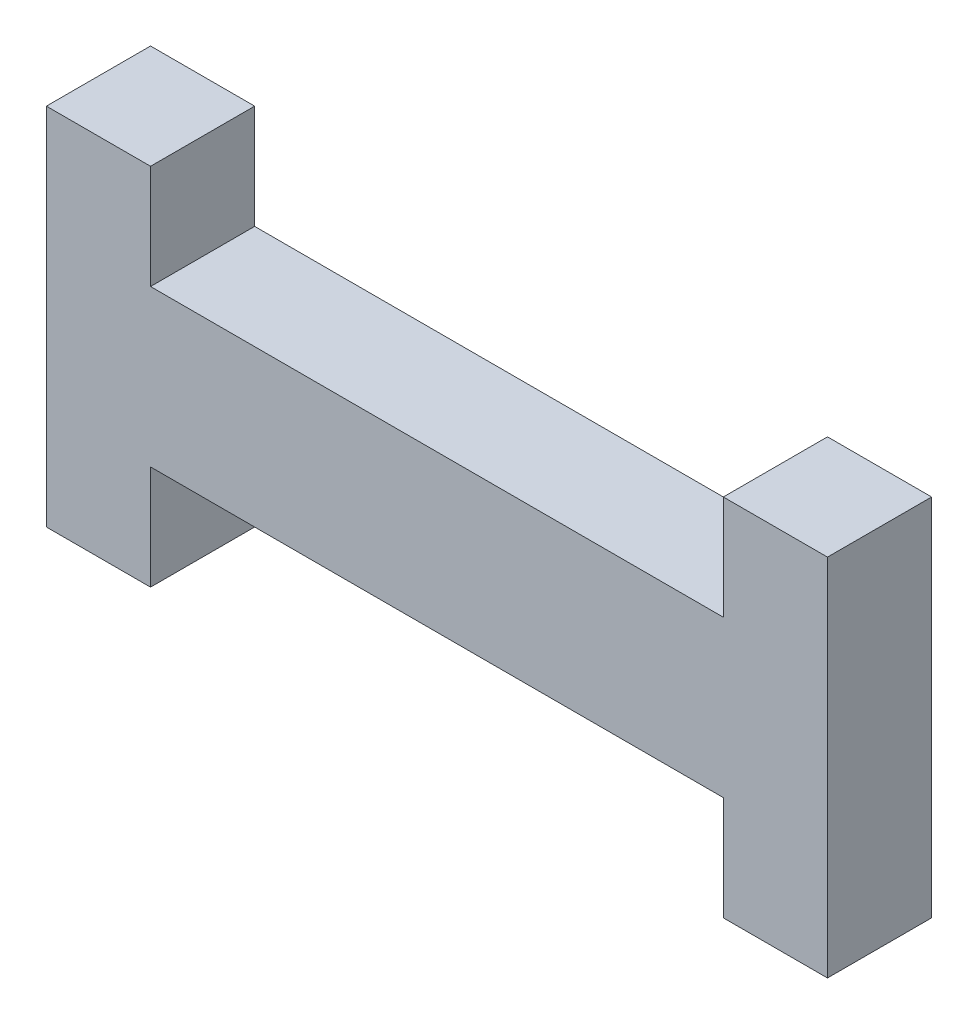
ISO-10303-21;
HEADER;
FILE_DESCRIPTION(('STEP AP214'),'2;1');
FILE_NAME('part.step','',(''),(''),'','','');
FILE_SCHEMA(('AUTOMOTIVE_DESIGN { 1 0 10303 214 1 1 1 1 }'));
ENDSEC;
DATA;
#1=APPLICATION_CONTEXT('core data for automotive mechanical design processes');
#2=APPLICATION_PROTOCOL_DEFINITION('international standard','automotive_design',2000,#1);
#3=PRODUCT_CONTEXT('',#1,'mechanical');
#4=PRODUCT('Part','Part','',(#3));
#5=PRODUCT_RELATED_PRODUCT_CATEGORY('part','',(#4));
#6=PRODUCT_DEFINITION_FORMATION('','',#4);
#7=PRODUCT_DEFINITION_CONTEXT('part definition',#1,'design');
#8=PRODUCT_DEFINITION('design','',#6,#7);
#9=PRODUCT_DEFINITION_SHAPE('','',#8);
#10=(LENGTH_UNIT() NAMED_UNIT(*) SI_UNIT(.MILLI.,.METRE.));
#11=(NAMED_UNIT(*) PLANE_ANGLE_UNIT() SI_UNIT($,.RADIAN.));
#12=(NAMED_UNIT(*) SI_UNIT($,.STERADIAN.) SOLID_ANGLE_UNIT());
#13=UNCERTAINTY_MEASURE_WITH_UNIT(LENGTH_MEASURE(1.E-05),#10,'distance_accuracy_value','');
#14=(GEOMETRIC_REPRESENTATION_CONTEXT(3) GLOBAL_UNCERTAINTY_ASSIGNED_CONTEXT((#13)) GLOBAL_UNIT_ASSIGNED_CONTEXT((#10,
#11,#12)) REPRESENTATION_CONTEXT('',''));
#15=CARTESIAN_POINT('',(0.,0.,0.));
#16=DIRECTION('',(0.,0.,1.));
#17=DIRECTION('',(1.,0.,0.));
#18=AXIS2_PLACEMENT_3D('',#15,#16,#17);
#19=CARTESIAN_POINT('',(0.,2.,2.));
#20=DIRECTION('',(-1.,0.,0.));
#21=DIRECTION('',(0.,-1.,0.));
#22=AXIS2_PLACEMENT_3D('',#19,#20,#21);
#23=PLANE('',#22);
#24=DIRECTION('',(0.,1.,0.));
#25=VECTOR('',#24,1.);
#26=CARTESIAN_POINT('',(0.,2.,0.));
#27=LINE('',#26,#25);
#28=CARTESIAN_POINT('',(0.,0.,0.));
#29=VERTEX_POINT('',#28);
#30=CARTESIAN_POINT('',(0.,2.,0.));
#31=VERTEX_POINT('',#30);
#32=EDGE_CURVE('E153',#29,#31,#27,.T.);
#33=ORIENTED_EDGE('',*,*,#32,.T.);
#34=DIRECTION('',(0.,0.,-1.));
#35=VECTOR('',#34,1.);
#36=CARTESIAN_POINT('',(0.,2.,2.));
#37=LINE('',#36,#35);
#38=CARTESIAN_POINT('',(0.,2.,2.));
#39=VERTEX_POINT('',#38);
#40=EDGE_CURVE('E11',#39,#31,#37,.T.);
#41=ORIENTED_EDGE('',*,*,#40,.F.);
#42=DIRECTION('',(0.,1.,0.));
#43=VECTOR('',#42,1.);
#44=CARTESIAN_POINT('',(0.,2.,2.));
#45=LINE('',#44,#43);
#46=CARTESIAN_POINT('',(0.,0.,2.));
#47=VERTEX_POINT('',#46);
#48=EDGE_CURVE('E175',#47,#39,#45,.T.);
#49=ORIENTED_EDGE('',*,*,#48,.F.);
#50=DIRECTION('',(0.,0.,-1.));
#51=VECTOR('',#50,1.);
#52=CARTESIAN_POINT('',(0.,0.,2.));
#53=LINE('',#52,#51);
#54=EDGE_CURVE('E149',#47,#29,#53,.T.);
#55=ORIENTED_EDGE('',*,*,#54,.T.);
#56=EDGE_LOOP('',(#33,#41,#49,#55));
#57=FACE_BOUND('',#56,.T.);
#58=ADVANCED_FACE('F33',(#57),#23,.F.);
#59=CARTESIAN_POINT('',(-2.,2.,2.));
#60=DIRECTION('',(0.,-1.,0.));
#61=DIRECTION('',(0.,0.,-1.));
#62=AXIS2_PLACEMENT_3D('',#59,#60,#61);
#63=PLANE('',#62);
#64=DIRECTION('',(-1.,0.,0.));
#65=VECTOR('',#64,1.);
#66=CARTESIAN_POINT('',(-2.,2.,0.));
#67=LINE('',#66,#65);
#68=CARTESIAN_POINT('',(-2.,2.,0.));
#69=VERTEX_POINT('',#68);
#70=EDGE_CURVE('E156',#31,#69,#67,.T.);
#71=ORIENTED_EDGE('',*,*,#70,.T.);
#72=DIRECTION('',(0.,0.,-1.));
#73=VECTOR('',#72,1.);
#74=CARTESIAN_POINT('',(-2.,2.,2.));
#75=LINE('',#74,#73);
#76=CARTESIAN_POINT('',(-2.,2.,2.));
#77=VERTEX_POINT('',#76);
#78=EDGE_CURVE('E41',#77,#69,#75,.T.);
#79=ORIENTED_EDGE('',*,*,#78,.F.);
#80=DIRECTION('',(-1.,0.,0.));
#81=VECTOR('',#80,1.);
#82=CARTESIAN_POINT('',(-2.,2.,2.));
#83=LINE('',#82,#81);
#84=EDGE_CURVE('E104',#39,#77,#83,.T.);
#85=ORIENTED_EDGE('',*,*,#84,.F.);
#86=ORIENTED_EDGE('',*,*,#40,.T.);
#87=EDGE_LOOP('',(#71,#79,#85,#86));
#88=FACE_BOUND('',#87,.T.);
#89=ADVANCED_FACE('F253',(#88),#63,.F.);
#90=CARTESIAN_POINT('',(-2.,-5.,2.));
#91=DIRECTION('',(1.,0.,0.));
#92=DIRECTION('',(0.,0.,-1.));
#93=AXIS2_PLACEMENT_3D('',#90,#91,#92);
#94=PLANE('',#93);
#95=DIRECTION('',(0.,-1.,0.));
#96=VECTOR('',#95,1.);
#97=CARTESIAN_POINT('',(-2.,-5.,0.));
#98=LINE('',#97,#96);
#99=CARTESIAN_POINT('',(-2.,-5.,0.));
#100=VERTEX_POINT('',#99);
#101=EDGE_CURVE('E158',#69,#100,#98,.T.);
#102=ORIENTED_EDGE('',*,*,#101,.T.);
#103=DIRECTION('',(0.,0.,-1.));
#104=VECTOR('',#103,1.);
#105=CARTESIAN_POINT('',(-2.,-5.,2.));
#106=LINE('',#105,#104);
#107=CARTESIAN_POINT('',(-2.,-5.,2.));
#108=VERTEX_POINT('',#107);
#109=EDGE_CURVE('E194',#108,#100,#106,.T.);
#110=ORIENTED_EDGE('',*,*,#109,.F.);
#111=DIRECTION('',(0.,-1.,0.));
#112=VECTOR('',#111,1.);
#113=CARTESIAN_POINT('',(-2.,-5.,2.));
#114=LINE('',#113,#112);
#115=EDGE_CURVE('E202',#77,#108,#114,.T.);
#116=ORIENTED_EDGE('',*,*,#115,.F.);
#117=ORIENTED_EDGE('',*,*,#78,.T.);
#118=EDGE_LOOP('',(#102,#110,#116,#117));
#119=FACE_BOUND('',#118,.T.);
#120=ADVANCED_FACE('F200',(#119),#94,.F.);
#121=CARTESIAN_POINT('',(0.,-5.,2.));
#122=DIRECTION('',(0.,1.,0.));
#123=DIRECTION('',(0.,0.,1.));
#124=AXIS2_PLACEMENT_3D('',#121,#122,#123);
#125=PLANE('',#124);
#126=DIRECTION('',(1.,0.,0.));
#127=VECTOR('',#126,1.);
#128=CARTESIAN_POINT('',(0.,-5.,0.));
#129=LINE('',#128,#127);
#130=CARTESIAN_POINT('',(0.,-5.,0.));
#131=VERTEX_POINT('',#130);
#132=EDGE_CURVE('E160',#100,#131,#129,.T.);
#133=ORIENTED_EDGE('',*,*,#132,.T.);
#134=DIRECTION('',(0.,0.,-1.));
#135=VECTOR('',#134,1.);
#136=CARTESIAN_POINT('',(0.,-5.,2.));
#137=LINE('',#136,#135);
#138=CARTESIAN_POINT('',(0.,-5.,2.));
#139=VERTEX_POINT('',#138);
#140=EDGE_CURVE('E191',#139,#131,#137,.T.);
#141=ORIENTED_EDGE('',*,*,#140,.F.);
#142=DIRECTION('',(1.,0.,0.));
#143=VECTOR('',#142,1.);
#144=CARTESIAN_POINT('',(0.,-5.,2.));
#145=LINE('',#144,#143);
#146=EDGE_CURVE('E220',#108,#139,#145,.T.);
#147=ORIENTED_EDGE('',*,*,#146,.F.);
#148=ORIENTED_EDGE('',*,*,#109,.T.);
#149=EDGE_LOOP('',(#133,#141,#147,#148));
#150=FACE_BOUND('',#149,.T.);
#151=ADVANCED_FACE('F211',(#150),#125,.F.);
#152=CARTESIAN_POINT('',(0.,-3.,2.));
#153=DIRECTION('',(-1.,0.,0.));
#154=DIRECTION('',(0.,-1.,0.));
#155=AXIS2_PLACEMENT_3D('',#152,#153,#154);
#156=PLANE('',#155);
#157=DIRECTION('',(0.,1.,0.));
#158=VECTOR('',#157,1.);
#159=CARTESIAN_POINT('',(0.,-3.,0.));
#160=LINE('',#159,#158);
#161=CARTESIAN_POINT('',(0.,-3.,0.));
#162=VERTEX_POINT('',#161);
#163=EDGE_CURVE('E162',#131,#162,#160,.T.);
#164=ORIENTED_EDGE('',*,*,#163,.T.);
#165=DIRECTION('',(0.,0.,-1.));
#166=VECTOR('',#165,1.);
#167=CARTESIAN_POINT('',(0.,-3.,2.));
#168=LINE('',#167,#166);
#169=CARTESIAN_POINT('',(0.,-3.,2.));
#170=VERTEX_POINT('',#169);
#171=EDGE_CURVE('E188',#170,#162,#168,.T.);
#172=ORIENTED_EDGE('',*,*,#171,.F.);
#173=DIRECTION('',(0.,1.,0.));
#174=VECTOR('',#173,1.);
#175=CARTESIAN_POINT('',(0.,-3.,2.));
#176=LINE('',#175,#174);
#177=EDGE_CURVE('E217',#139,#170,#176,.T.);
#178=ORIENTED_EDGE('',*,*,#177,.F.);
#179=ORIENTED_EDGE('',*,*,#140,.T.);
#180=EDGE_LOOP('',(#164,#172,#178,#179));
#181=FACE_BOUND('',#180,.T.);
#182=ADVANCED_FACE('F215',(#181),#156,.F.);
#183=CARTESIAN_POINT('',(11.,-3.,2.));
#184=DIRECTION('',(0.,1.,0.));
#185=DIRECTION('',(-1.,0.,0.));
#186=AXIS2_PLACEMENT_3D('',#183,#184,#185);
#187=PLANE('',#186);
#188=DIRECTION('',(1.,0.,0.));
#189=VECTOR('',#188,1.);
#190=CARTESIAN_POINT('',(11.,-3.,0.));
#191=LINE('',#190,#189);
#192=CARTESIAN_POINT('',(11.,-3.,0.));
#193=VERTEX_POINT('',#192);
#194=EDGE_CURVE('E164',#162,#193,#191,.T.);
#195=ORIENTED_EDGE('',*,*,#194,.T.);
#196=DIRECTION('',(0.,0.,-1.));
#197=VECTOR('',#196,1.);
#198=CARTESIAN_POINT('',(11.,-3.,2.));
#199=LINE('',#198,#197);
#200=CARTESIAN_POINT('',(11.,-3.,2.));
#201=VERTEX_POINT('',#200);
#202=EDGE_CURVE('E185',#201,#193,#199,.T.);
#203=ORIENTED_EDGE('',*,*,#202,.F.);
#204=DIRECTION('',(1.,0.,0.));
#205=VECTOR('',#204,1.);
#206=CARTESIAN_POINT('',(11.,-3.,2.));
#207=LINE('',#206,#205);
#208=EDGE_CURVE('E219',#170,#201,#207,.T.);
#209=ORIENTED_EDGE('',*,*,#208,.F.);
#210=ORIENTED_EDGE('',*,*,#171,.T.);
#211=EDGE_LOOP('',(#195,#203,#209,#210));
#212=FACE_BOUND('',#211,.T.);
#213=ADVANCED_FACE('F266',(#212),#187,.F.);
#214=CARTESIAN_POINT('',(11.,-5.,2.));
#215=DIRECTION('',(1.,0.,0.));
#216=DIRECTION('',(0.,0.,-1.));
#217=AXIS2_PLACEMENT_3D('',#214,#215,#216);
#218=PLANE('',#217);
#219=DIRECTION('',(0.,-1.,0.));
#220=VECTOR('',#219,1.);
#221=CARTESIAN_POINT('',(11.,-5.,0.));
#222=LINE('',#221,#220);
#223=CARTESIAN_POINT('',(11.,-5.,0.));
#224=VERTEX_POINT('',#223);
#225=EDGE_CURVE('E166',#193,#224,#222,.T.);
#226=ORIENTED_EDGE('',*,*,#225,.T.);
#227=DIRECTION('',(0.,0.,-1.));
#228=VECTOR('',#227,1.);
#229=CARTESIAN_POINT('',(11.,-5.,2.));
#230=LINE('',#229,#228);
#231=CARTESIAN_POINT('',(11.,-5.,2.));
#232=VERTEX_POINT('',#231);
#233=EDGE_CURVE('E182',#232,#224,#230,.T.);
#234=ORIENTED_EDGE('',*,*,#233,.F.);
#235=DIRECTION('',(0.,-1.,0.));
#236=VECTOR('',#235,1.);
#237=CARTESIAN_POINT('',(11.,-5.,2.));
#238=LINE('',#237,#236);
#239=EDGE_CURVE('E222',#201,#232,#238,.T.);
#240=ORIENTED_EDGE('',*,*,#239,.F.);
#241=ORIENTED_EDGE('',*,*,#202,.T.);
#242=EDGE_LOOP('',(#226,#234,#240,#241));
#243=FACE_BOUND('',#242,.T.);
#244=ADVANCED_FACE('F269',(#243),#218,.F.);
#245=CARTESIAN_POINT('',(13.,-5.,2.));
#246=DIRECTION('',(0.,1.,0.));
#247=DIRECTION('',(-1.,0.,0.));
#248=AXIS2_PLACEMENT_3D('',#245,#246,#247);
#249=PLANE('',#248);
#250=DIRECTION('',(1.,0.,0.));
#251=VECTOR('',#250,1.);
#252=CARTESIAN_POINT('',(13.,-5.,0.));
#253=LINE('',#252,#251);
#254=CARTESIAN_POINT('',(13.,-5.,0.));
#255=VERTEX_POINT('',#254);
#256=EDGE_CURVE('E168',#224,#255,#253,.T.);
#257=ORIENTED_EDGE('',*,*,#256,.T.);
#258=DIRECTION('',(0.,0.,-1.));
#259=VECTOR('',#258,1.);
#260=CARTESIAN_POINT('',(13.,-5.,2.));
#261=LINE('',#260,#259);
#262=CARTESIAN_POINT('',(13.,-5.,2.));
#263=VERTEX_POINT('',#262);
#264=EDGE_CURVE('E179',#263,#255,#261,.T.);
#265=ORIENTED_EDGE('',*,*,#264,.F.);
#266=DIRECTION('',(1.,0.,0.));
#267=VECTOR('',#266,1.);
#268=CARTESIAN_POINT('',(13.,-5.,2.));
#269=LINE('',#268,#267);
#270=EDGE_CURVE('E228',#232,#263,#269,.T.);
#271=ORIENTED_EDGE('',*,*,#270,.F.);
#272=ORIENTED_EDGE('',*,*,#233,.T.);
#273=EDGE_LOOP('',(#257,#265,#271,#272));
#274=FACE_BOUND('',#273,.T.);
#275=ADVANCED_FACE('F234',(#274),#249,.F.);
#276=CARTESIAN_POINT('',(13.,2.,2.));
#277=DIRECTION('',(-1.,0.,0.));
#278=DIRECTION('',(0.,0.,1.));
#279=AXIS2_PLACEMENT_3D('',#276,#277,#278);
#280=PLANE('',#279);
#281=DIRECTION('',(0.,1.,0.));
#282=VECTOR('',#281,1.);
#283=CARTESIAN_POINT('',(13.,2.,0.));
#284=LINE('',#283,#282);
#285=CARTESIAN_POINT('',(13.,2.,0.));
#286=VERTEX_POINT('',#285);
#287=EDGE_CURVE('E170',#255,#286,#284,.T.);
#288=ORIENTED_EDGE('',*,*,#287,.T.);
#289=DIRECTION('',(0.,0.,-1.));
#290=VECTOR('',#289,1.);
#291=CARTESIAN_POINT('',(13.,2.,2.));
#292=LINE('',#291,#290);
#293=CARTESIAN_POINT('',(13.,2.,2.));
#294=VERTEX_POINT('',#293);
#295=EDGE_CURVE('E144',#294,#286,#292,.T.);
#296=ORIENTED_EDGE('',*,*,#295,.F.);
#297=DIRECTION('',(0.,1.,0.));
#298=VECTOR('',#297,1.);
#299=CARTESIAN_POINT('',(13.,2.,2.));
#300=LINE('',#299,#298);
#301=EDGE_CURVE('E135',#263,#294,#300,.T.);
#302=ORIENTED_EDGE('',*,*,#301,.F.);
#303=ORIENTED_EDGE('',*,*,#264,.T.);
#304=EDGE_LOOP('',(#288,#296,#302,#303));
#305=FACE_BOUND('',#304,.T.);
#306=ADVANCED_FACE('F238',(#305),#280,.F.);
#307=CARTESIAN_POINT('',(11.,2.,2.));
#308=DIRECTION('',(0.,-1.,0.));
#309=DIRECTION('',(0.,0.,-1.));
#310=AXIS2_PLACEMENT_3D('',#307,#308,#309);
#311=PLANE('',#310);
#312=DIRECTION('',(-1.,0.,0.));
#313=VECTOR('',#312,1.);
#314=CARTESIAN_POINT('',(11.,2.,0.));
#315=LINE('',#314,#313);
#316=CARTESIAN_POINT('',(11.,2.,0.));
#317=VERTEX_POINT('',#316);
#318=EDGE_CURVE('E143',#286,#317,#315,.T.);
#319=ORIENTED_EDGE('',*,*,#318,.T.);
#320=DIRECTION('',(0.,0.,-1.));
#321=VECTOR('',#320,1.);
#322=CARTESIAN_POINT('',(11.,2.,2.));
#323=LINE('',#322,#321);
#324=CARTESIAN_POINT('',(11.,2.,2.));
#325=VERTEX_POINT('',#324);
#326=EDGE_CURVE('E140',#325,#317,#323,.T.);
#327=ORIENTED_EDGE('',*,*,#326,.F.);
#328=DIRECTION('',(-1.,0.,0.));
#329=VECTOR('',#328,1.);
#330=CARTESIAN_POINT('',(11.,2.,2.));
#331=LINE('',#330,#329);
#332=EDGE_CURVE('E129',#294,#325,#331,.T.);
#333=ORIENTED_EDGE('',*,*,#332,.F.);
#334=ORIENTED_EDGE('',*,*,#295,.T.);
#335=EDGE_LOOP('',(#319,#327,#333,#334));
#336=FACE_BOUND('',#335,.T.);
#337=ADVANCED_FACE('F141',(#336),#311,.F.);
#338=CARTESIAN_POINT('',(11.,0.,2.));
#339=DIRECTION('',(1.,0.,0.));
#340=DIRECTION('',(0.,0.,-1.));
#341=AXIS2_PLACEMENT_3D('',#338,#339,#340);
#342=PLANE('',#341);
#343=DIRECTION('',(0.,-1.,0.));
#344=VECTOR('',#343,1.);
#345=CARTESIAN_POINT('',(11.,0.,0.));
#346=LINE('',#345,#344);
#347=CARTESIAN_POINT('',(11.,0.,0.));
#348=VERTEX_POINT('',#347);
#349=EDGE_CURVE('E90',#317,#348,#346,.T.);
#350=ORIENTED_EDGE('',*,*,#349,.T.);
#351=DIRECTION('',(0.,0.,-1.));
#352=VECTOR('',#351,1.);
#353=CARTESIAN_POINT('',(11.,0.,2.));
#354=LINE('',#353,#352);
#355=CARTESIAN_POINT('',(11.,0.,2.));
#356=VERTEX_POINT('',#355);
#357=EDGE_CURVE('E145',#356,#348,#354,.T.);
#358=ORIENTED_EDGE('',*,*,#357,.F.);
#359=DIRECTION('',(0.,-1.,0.));
#360=VECTOR('',#359,1.);
#361=CARTESIAN_POINT('',(11.,0.,2.));
#362=LINE('',#361,#360);
#363=EDGE_CURVE('E133',#325,#356,#362,.T.);
#364=ORIENTED_EDGE('',*,*,#363,.F.);
#365=ORIENTED_EDGE('',*,*,#326,.T.);
#366=EDGE_LOOP('',(#350,#358,#364,#365));
#367=FACE_BOUND('',#366,.T.);
#368=ADVANCED_FACE('F147',(#367),#342,.F.);
#369=CARTESIAN_POINT('',(0.,0.,2.));
#370=DIRECTION('',(0.,-1.,0.));
#371=DIRECTION('',(0.,0.,-1.));
#372=AXIS2_PLACEMENT_3D('',#369,#370,#371);
#373=PLANE('',#372);
#374=DIRECTION('',(-1.,0.,0.));
#375=VECTOR('',#374,1.);
#376=CARTESIAN_POINT('',(0.,0.,0.));
#377=LINE('',#376,#375);
#378=EDGE_CURVE('E96',#348,#29,#377,.T.);
#379=ORIENTED_EDGE('',*,*,#378,.T.);
#380=ORIENTED_EDGE('',*,*,#54,.F.);
#381=DIRECTION('',(-1.,0.,0.));
#382=VECTOR('',#381,1.);
#383=CARTESIAN_POINT('',(0.,0.,2.));
#384=LINE('',#383,#382);
#385=EDGE_CURVE('E49',#356,#47,#384,.T.);
#386=ORIENTED_EDGE('',*,*,#385,.F.);
#387=ORIENTED_EDGE('',*,*,#357,.T.);
#388=EDGE_LOOP('',(#379,#380,#386,#387));
#389=FACE_BOUND('',#388,.T.);
#390=ADVANCED_FACE('F242',(#389),#373,.F.);
#391=CARTESIAN_POINT('',(0.,0.,2.));
#392=DIRECTION('',(0.,0.,1.));
#393=DIRECTION('',(1.,0.,0.));
#394=AXIS2_PLACEMENT_3D('',#391,#392,#393);
#395=PLANE('',#394);
#396=ORIENTED_EDGE('',*,*,#48,.T.);
#397=ORIENTED_EDGE('',*,*,#84,.T.);
#398=ORIENTED_EDGE('',*,*,#115,.T.);
#399=ORIENTED_EDGE('',*,*,#146,.T.);
#400=ORIENTED_EDGE('',*,*,#177,.T.);
#401=ORIENTED_EDGE('',*,*,#208,.T.);
#402=ORIENTED_EDGE('',*,*,#239,.T.);
#403=ORIENTED_EDGE('',*,*,#270,.T.);
#404=ORIENTED_EDGE('',*,*,#301,.T.);
#405=ORIENTED_EDGE('',*,*,#332,.T.);
#406=ORIENTED_EDGE('',*,*,#363,.T.);
#407=ORIENTED_EDGE('',*,*,#385,.T.);
#408=EDGE_LOOP('',(#396,#397,#398,#399,#400,#401,#402,#403,#404,#405,#406,#407));
#409=FACE_BOUND('',#408,.T.);
#410=ADVANCED_FACE('F131',(#409),#395,.T.);
#411=CARTESIAN_POINT('',(0.,0.,0.));
#412=DIRECTION('',(0.,0.,1.));
#413=DIRECTION('',(1.,0.,0.));
#414=AXIS2_PLACEMENT_3D('',#411,#412,#413);
#415=PLANE('',#414);
#416=ORIENTED_EDGE('',*,*,#32,.F.);
#417=ORIENTED_EDGE('',*,*,#378,.F.);
#418=ORIENTED_EDGE('',*,*,#349,.F.);
#419=ORIENTED_EDGE('',*,*,#318,.F.);
#420=ORIENTED_EDGE('',*,*,#287,.F.);
#421=ORIENTED_EDGE('',*,*,#256,.F.);
#422=ORIENTED_EDGE('',*,*,#225,.F.);
#423=ORIENTED_EDGE('',*,*,#194,.F.);
#424=ORIENTED_EDGE('',*,*,#163,.F.);
#425=ORIENTED_EDGE('',*,*,#132,.F.);
#426=ORIENTED_EDGE('',*,*,#101,.F.);
#427=ORIENTED_EDGE('',*,*,#70,.F.);
#428=EDGE_LOOP('',(#416,#417,#418,#419,#420,#421,#422,#423,#424,#425,#426,#427));
#429=FACE_BOUND('',#428,.T.);
#430=ADVANCED_FACE('F206',(#429),#415,.F.);
#431=CLOSED_SHELL('',(#58,#89,#120,#151,#182,#213,#244,#275,#306,#337,#368,#390,#410,#430));
#432=MANIFOLD_SOLID_BREP('B2',#431);
#433=ADVANCED_BREP_SHAPE_REPRESENTATION('',(#18,#432),#14);
#434=SHAPE_DEFINITION_REPRESENTATION(#9,#433);
ENDSEC;
END-ISO-10303-21;
